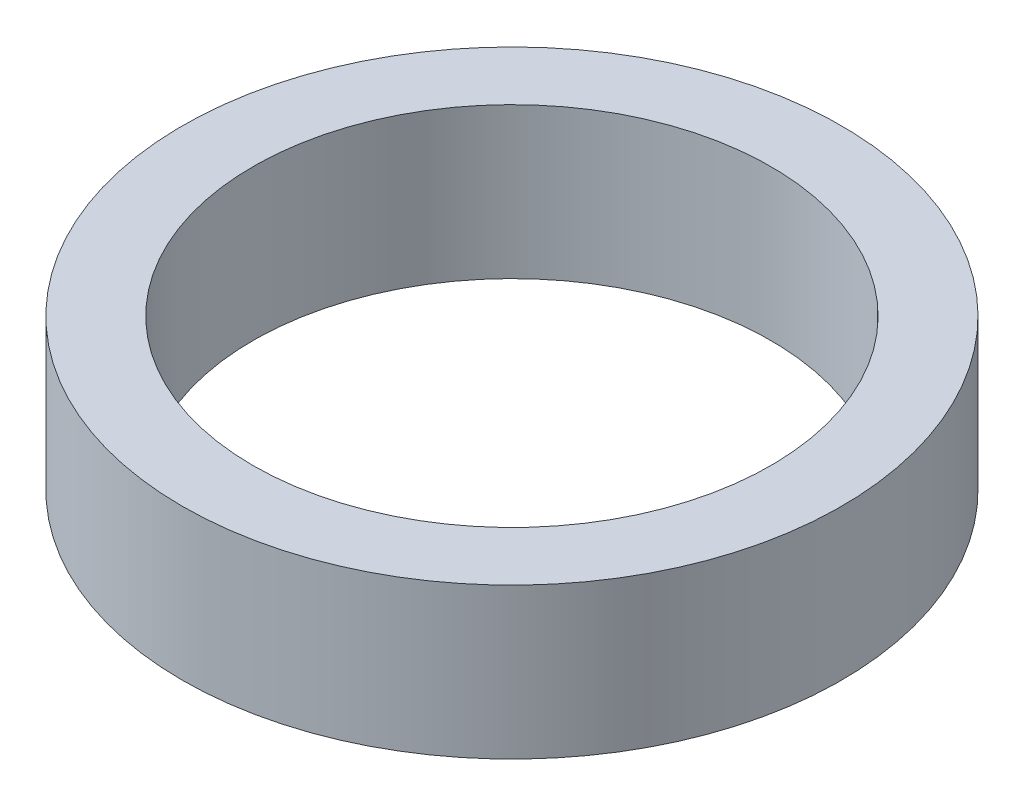
ISO-10303-21;
HEADER;
FILE_DESCRIPTION(('STEP AP214'),'2;1');
FILE_NAME('part.step','',(''),(''),'','','');
FILE_SCHEMA(('AUTOMOTIVE_DESIGN { 1 0 10303 214 1 1 1 1 }'));
ENDSEC;
DATA;
#1=APPLICATION_CONTEXT('core data for automotive mechanical design processes');
#2=APPLICATION_PROTOCOL_DEFINITION('international standard','automotive_design',2000,#1);
#3=PRODUCT_CONTEXT('',#1,'mechanical');
#4=PRODUCT('Part','Part','',(#3));
#5=PRODUCT_RELATED_PRODUCT_CATEGORY('part','',(#4));
#6=PRODUCT_DEFINITION_FORMATION('','',#4);
#7=PRODUCT_DEFINITION_CONTEXT('part definition',#1,'design');
#8=PRODUCT_DEFINITION('design','',#6,#7);
#9=PRODUCT_DEFINITION_SHAPE('','',#8);
#10=(LENGTH_UNIT() NAMED_UNIT(*) SI_UNIT(.MILLI.,.METRE.));
#11=(NAMED_UNIT(*) PLANE_ANGLE_UNIT() SI_UNIT($,.RADIAN.));
#12=(NAMED_UNIT(*) SI_UNIT($,.STERADIAN.) SOLID_ANGLE_UNIT());
#13=UNCERTAINTY_MEASURE_WITH_UNIT(LENGTH_MEASURE(1.E-05),#10,'distance_accuracy_value','');
#14=(GEOMETRIC_REPRESENTATION_CONTEXT(3) GLOBAL_UNCERTAINTY_ASSIGNED_CONTEXT((#13)) GLOBAL_UNIT_ASSIGNED_CONTEXT((#10,
#11,#12)) REPRESENTATION_CONTEXT('',''));
#15=CARTESIAN_POINT('',(0.,0.,0.));
#16=DIRECTION('',(0.,0.,1.));
#17=DIRECTION('',(1.,0.,0.));
#18=AXIS2_PLACEMENT_3D('',#15,#16,#17);
#19=CARTESIAN_POINT('',(0.,16.,0.));
#20=DIRECTION('',(0.,-1.,0.));
#21=DIRECTION('',(0.,0.,-1.));
#22=AXIS2_PLACEMENT_3D('',#19,#20,#21);
#23=CYLINDRICAL_SURFACE('',#22,35.);
#24=CARTESIAN_POINT('',(0.,16.,0.));
#25=DIRECTION('',(0.,1.,0.));
#26=DIRECTION('',(0.,0.,1.));
#27=AXIS2_PLACEMENT_3D('',#24,#25,#26);
#28=CIRCLE('',#27,35.);
#29=CARTESIAN_POINT('',(0.,16.,35.));
#30=VERTEX_POINT('',#29);
#31=EDGE_CURVE('E10',#30,#30,#28,.T.);
#32=ORIENTED_EDGE('',*,*,#31,.F.);
#33=EDGE_LOOP('',(#32));
#34=FACE_BOUND('',#33,.T.);
#35=CARTESIAN_POINT('',(0.,0.,0.));
#36=DIRECTION('',(0.,1.,0.));
#37=DIRECTION('',(0.,0.,1.));
#38=AXIS2_PLACEMENT_3D('',#35,#36,#37);
#39=CIRCLE('',#38,35.);
#40=CARTESIAN_POINT('',(0.,0.,35.));
#41=VERTEX_POINT('',#40);
#42=EDGE_CURVE('E37',#41,#41,#39,.T.);
#43=ORIENTED_EDGE('',*,*,#42,.T.);
#44=EDGE_LOOP('',(#43));
#45=FACE_BOUND('',#44,.T.);
#46=ADVANCED_FACE('F40',(#34,#45),#23,.T.);
#47=CARTESIAN_POINT('',(0.,16.,0.));
#48=DIRECTION('',(0.,1.,0.));
#49=DIRECTION('',(0.,0.,1.));
#50=AXIS2_PLACEMENT_3D('',#47,#48,#49);
#51=PLANE('',#50);
#52=CARTESIAN_POINT('',(0.,16.,0.));
#53=DIRECTION('',(0.,1.,0.));
#54=DIRECTION('',(0.,0.,1.));
#55=AXIS2_PLACEMENT_3D('',#52,#53,#54);
#56=CIRCLE('',#55,27.5);
#57=CARTESIAN_POINT('',(0.,16.,27.5));
#58=VERTEX_POINT('',#57);
#59=EDGE_CURVE('E50',#58,#58,#56,.T.);
#60=ORIENTED_EDGE('',*,*,#59,.F.);
#61=EDGE_LOOP('',(#60));
#62=FACE_BOUND('',#61,.T.);
#63=ORIENTED_EDGE('',*,*,#31,.T.);
#64=EDGE_LOOP('',(#63));
#65=FACE_BOUND('',#64,.T.);
#66=ADVANCED_FACE('F59',(#62,#65),#51,.T.);
#67=CARTESIAN_POINT('',(0.,0.,0.));
#68=DIRECTION('',(0.,1.,0.));
#69=DIRECTION('',(0.,0.,1.));
#70=AXIS2_PLACEMENT_3D('',#67,#68,#69);
#71=PLANE('',#70);
#72=CARTESIAN_POINT('',(0.,0.,0.));
#73=DIRECTION('',(0.,1.,0.));
#74=DIRECTION('',(0.,0.,1.));
#75=AXIS2_PLACEMENT_3D('',#72,#73,#74);
#76=CIRCLE('',#75,27.5);
#77=CARTESIAN_POINT('',(0.,0.,27.5));
#78=VERTEX_POINT('',#77);
#79=EDGE_CURVE('E47',#78,#78,#76,.T.);
#80=ORIENTED_EDGE('',*,*,#79,.T.);
#81=EDGE_LOOP('',(#80));
#82=FACE_BOUND('',#81,.T.);
#83=ORIENTED_EDGE('',*,*,#42,.F.);
#84=EDGE_LOOP('',(#83));
#85=FACE_BOUND('',#84,.T.);
#86=ADVANCED_FACE('F58',(#82,#85),#71,.F.);
#87=CARTESIAN_POINT('',(0.,16.,0.));
#88=DIRECTION('',(0.,-1.,0.));
#89=DIRECTION('',(0.,0.,-1.));
#90=AXIS2_PLACEMENT_3D('',#87,#88,#89);
#91=CYLINDRICAL_SURFACE('',#90,27.5);
#92=ORIENTED_EDGE('',*,*,#59,.T.);
#93=EDGE_LOOP('',(#92));
#94=FACE_BOUND('',#93,.T.);
#95=ORIENTED_EDGE('',*,*,#79,.F.);
#96=EDGE_LOOP('',(#95));
#97=FACE_BOUND('',#96,.T.);
#98=ADVANCED_FACE('F54',(#94,#97),#91,.F.);
#99=CLOSED_SHELL('',(#46,#66,#86,#98));
#100=MANIFOLD_SOLID_BREP('B2',#99);
#101=ADVANCED_BREP_SHAPE_REPRESENTATION('',(#18,#100),#14);
#102=SHAPE_DEFINITION_REPRESENTATION(#9,#101);
ENDSEC;
END-ISO-10303-21;
